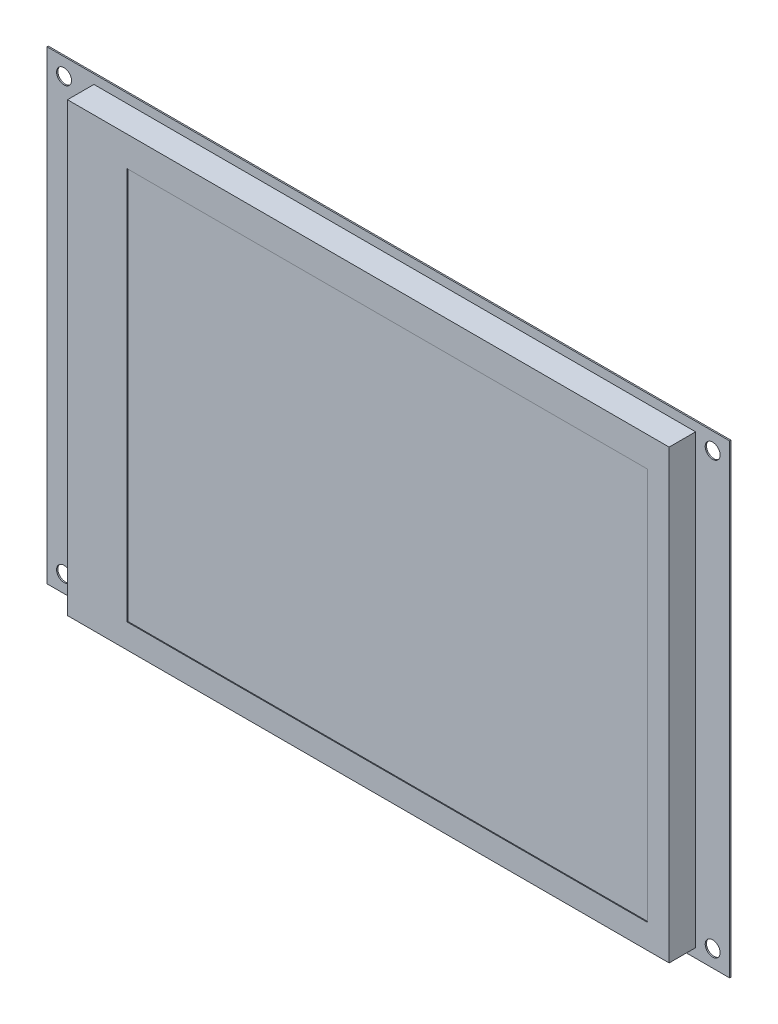
ISO-10303-21;
HEADER;
FILE_DESCRIPTION(('STEP AP214'),'2;1');
FILE_NAME('part.step','',(''),(''),'','','');
FILE_SCHEMA(('AUTOMOTIVE_DESIGN { 1 0 10303 214 1 1 1 1 }'));
ENDSEC;
DATA;
#1=APPLICATION_CONTEXT('core data for automotive mechanical design processes');
#2=APPLICATION_PROTOCOL_DEFINITION('international standard','automotive_design',2000,#1);
#3=PRODUCT_CONTEXT('',#1,'mechanical');
#4=PRODUCT('Part','Part','',(#3));
#5=PRODUCT_RELATED_PRODUCT_CATEGORY('part','',(#4));
#6=PRODUCT_DEFINITION_FORMATION('','',#4);
#7=PRODUCT_DEFINITION_CONTEXT('part definition',#1,'design');
#8=PRODUCT_DEFINITION('design','',#6,#7);
#9=PRODUCT_DEFINITION_SHAPE('','',#8);
#10=(LENGTH_UNIT() NAMED_UNIT(*) SI_UNIT(.MILLI.,.METRE.));
#11=(NAMED_UNIT(*) PLANE_ANGLE_UNIT() SI_UNIT($,.RADIAN.));
#12=(NAMED_UNIT(*) SI_UNIT($,.STERADIAN.) SOLID_ANGLE_UNIT());
#13=UNCERTAINTY_MEASURE_WITH_UNIT(LENGTH_MEASURE(1.E-05),#10,'distance_accuracy_value','');
#14=(GEOMETRIC_REPRESENTATION_CONTEXT(3) GLOBAL_UNCERTAINTY_ASSIGNED_CONTEXT((#13)) GLOBAL_UNIT_ASSIGNED_CONTEXT((#10,
#11,#12)) REPRESENTATION_CONTEXT('',''));
#15=CARTESIAN_POINT('',(0.,0.,0.));
#16=DIRECTION('',(0.,0.,1.));
#17=DIRECTION('',(1.,0.,0.));
#18=AXIS2_PLACEMENT_3D('',#15,#16,#17);
#19=CARTESIAN_POINT('',(0.,0.,6.20000000000001));
#20=DIRECTION('',(1.,0.,0.));
#21=DIRECTION('',(0.,1.,0.));
#22=AXIS2_PLACEMENT_3D('',#19,#20,#21);
#23=PLANE('',#22);
#24=DIRECTION('',(0.,-1.,0.));
#25=VECTOR('',#24,1.);
#26=CARTESIAN_POINT('',(0.,0.,0.));
#27=LINE('',#26,#25);
#28=CARTESIAN_POINT('',(0.,0.,0.));
#29=VERTEX_POINT('',#28);
#30=CARTESIAN_POINT('',(0.,-104.7,0.));
#31=VERTEX_POINT('',#30);
#32=EDGE_CURVE('E206',#29,#31,#27,.T.);
#33=ORIENTED_EDGE('',*,*,#32,.T.);
#34=DIRECTION('',(0.,0.,-1.));
#35=VECTOR('',#34,1.);
#36=CARTESIAN_POINT('',(0.,-104.7,6.20000000000001));
#37=LINE('',#36,#35);
#38=CARTESIAN_POINT('',(0.,-104.7,6.20000000000001));
#39=VERTEX_POINT('',#38);
#40=EDGE_CURVE('E11',#39,#31,#37,.T.);
#41=ORIENTED_EDGE('',*,*,#40,.F.);
#42=DIRECTION('',(0.,-1.,0.));
#43=VECTOR('',#42,1.);
#44=CARTESIAN_POINT('',(0.,0.,6.20000000000001));
#45=LINE('',#44,#43);
#46=CARTESIAN_POINT('',(0.,0.,6.20000000000001));
#47=VERTEX_POINT('',#46);
#48=EDGE_CURVE('E218',#47,#39,#45,.T.);
#49=ORIENTED_EDGE('',*,*,#48,.F.);
#50=DIRECTION('',(0.,0.,-1.));
#51=VECTOR('',#50,1.);
#52=CARTESIAN_POINT('',(0.,0.,6.20000000000001));
#53=LINE('',#52,#51);
#54=EDGE_CURVE('E225',#47,#29,#53,.T.);
#55=ORIENTED_EDGE('',*,*,#54,.T.);
#56=EDGE_LOOP('',(#33,#41,#49,#55));
#57=FACE_BOUND('',#56,.T.);
#58=ADVANCED_FACE('F24',(#57),#23,.F.);
#59=CARTESIAN_POINT('',(0.,-104.7,6.20000000000001));
#60=DIRECTION('',(0.,1.,0.));
#61=DIRECTION('',(-1.,0.,0.));
#62=AXIS2_PLACEMENT_3D('',#59,#60,#61);
#63=PLANE('',#62);
#64=DIRECTION('',(1.,0.,0.));
#65=VECTOR('',#64,1.);
#66=CARTESIAN_POINT('',(0.,-104.7,0.));
#67=LINE('',#66,#65);
#68=CARTESIAN_POINT('',(141.,-104.7,0.));
#69=VERTEX_POINT('',#68);
#70=EDGE_CURVE('E209',#31,#69,#67,.T.);
#71=ORIENTED_EDGE('',*,*,#70,.T.);
#72=DIRECTION('',(0.,0.,-1.));
#73=VECTOR('',#72,1.);
#74=CARTESIAN_POINT('',(141.,-104.7,6.20000000000001));
#75=LINE('',#74,#73);
#76=CARTESIAN_POINT('',(141.,-104.7,6.20000000000001));
#77=VERTEX_POINT('',#76);
#78=EDGE_CURVE('E31',#77,#69,#75,.T.);
#79=ORIENTED_EDGE('',*,*,#78,.F.);
#80=DIRECTION('',(1.,0.,0.));
#81=VECTOR('',#80,1.);
#82=CARTESIAN_POINT('',(0.,-104.7,6.20000000000001));
#83=LINE('',#82,#81);
#84=EDGE_CURVE('E220',#39,#77,#83,.T.);
#85=ORIENTED_EDGE('',*,*,#84,.F.);
#86=ORIENTED_EDGE('',*,*,#40,.T.);
#87=EDGE_LOOP('',(#71,#79,#85,#86));
#88=FACE_BOUND('',#87,.T.);
#89=ADVANCED_FACE('F237',(#88),#63,.F.);
#90=CARTESIAN_POINT('',(141.,0.,6.20000000000001));
#91=DIRECTION('',(-1.,0.,0.));
#92=DIRECTION('',(0.,0.,1.));
#93=AXIS2_PLACEMENT_3D('',#90,#91,#92);
#94=PLANE('',#93);
#95=DIRECTION('',(0.,1.,0.));
#96=VECTOR('',#95,1.);
#97=CARTESIAN_POINT('',(141.,0.,0.));
#98=LINE('',#97,#96);
#99=CARTESIAN_POINT('',(141.,0.,0.));
#100=VERTEX_POINT('',#99);
#101=EDGE_CURVE('E212',#69,#100,#98,.T.);
#102=ORIENTED_EDGE('',*,*,#101,.T.);
#103=DIRECTION('',(0.,0.,-1.));
#104=VECTOR('',#103,1.);
#105=CARTESIAN_POINT('',(141.,0.,6.20000000000001));
#106=LINE('',#105,#104);
#107=CARTESIAN_POINT('',(141.,0.,6.20000000000001));
#108=VERTEX_POINT('',#107);
#109=EDGE_CURVE('E228',#108,#100,#106,.T.);
#110=ORIENTED_EDGE('',*,*,#109,.F.);
#111=DIRECTION('',(0.,1.,0.));
#112=VECTOR('',#111,1.);
#113=CARTESIAN_POINT('',(141.,0.,6.20000000000001));
#114=LINE('',#113,#112);
#115=EDGE_CURVE('E222',#77,#108,#114,.T.);
#116=ORIENTED_EDGE('',*,*,#115,.F.);
#117=ORIENTED_EDGE('',*,*,#78,.T.);
#118=EDGE_LOOP('',(#102,#110,#116,#117));
#119=FACE_BOUND('',#118,.T.);
#120=ADVANCED_FACE('F234',(#119),#94,.F.);
#121=CARTESIAN_POINT('',(0.,0.,6.20000000000001));
#122=DIRECTION('',(0.,-1.,0.));
#123=DIRECTION('',(0.,0.,-1.));
#124=AXIS2_PLACEMENT_3D('',#121,#122,#123);
#125=PLANE('',#124);
#126=DIRECTION('',(-1.,0.,0.));
#127=VECTOR('',#126,1.);
#128=CARTESIAN_POINT('',(0.,0.,0.));
#129=LINE('',#128,#127);
#130=EDGE_CURVE('E215',#100,#29,#129,.T.);
#131=ORIENTED_EDGE('',*,*,#130,.T.);
#132=ORIENTED_EDGE('',*,*,#54,.F.);
#133=DIRECTION('',(-1.,0.,0.));
#134=VECTOR('',#133,1.);
#135=CARTESIAN_POINT('',(0.,0.,6.20000000000001));
#136=LINE('',#135,#134);
#137=EDGE_CURVE('E46',#108,#47,#136,.T.);
#138=ORIENTED_EDGE('',*,*,#137,.F.);
#139=ORIENTED_EDGE('',*,*,#109,.T.);
#140=EDGE_LOOP('',(#131,#132,#138,#139));
#141=FACE_BOUND('',#140,.T.);
#142=ADVANCED_FACE('F242',(#141),#125,.F.);
#143=CARTESIAN_POINT('',(0.,-104.7,6.20000000000001));
#144=DIRECTION('',(0.,0.,1.));
#145=DIRECTION('',(1.,0.,0.));
#146=AXIS2_PLACEMENT_3D('',#143,#144,#145);
#147=PLANE('',#146);
#148=DIRECTION('',(0.,-1.,0.));
#149=VECTOR('',#148,1.);
#150=CARTESIAN_POINT('',(13.9858066683462,-6.99852607709749,6.20000000000001));
#151=LINE('',#150,#149);
#152=CARTESIAN_POINT('',(13.9858066683462,-6.99852607709749,6.20000000000001));
#153=VERTEX_POINT('',#152);
#154=CARTESIAN_POINT('',(13.9858066683462,-98.9985260770975,6.20000000000001));
#155=VERTEX_POINT('',#154);
#156=EDGE_CURVE('E38',#153,#155,#151,.T.);
#157=ORIENTED_EDGE('',*,*,#156,.F.);
#158=DIRECTION('',(-1.,0.,0.));
#159=VECTOR('',#158,1.);
#160=CARTESIAN_POINT('',(13.9858066683462,-6.99852607709749,6.20000000000001));
#161=LINE('',#160,#159);
#162=CARTESIAN_POINT('',(135.985806668346,-6.99852607709749,6.20000000000001));
#163=VERTEX_POINT('',#162);
#164=EDGE_CURVE('E134',#163,#153,#161,.T.);
#165=ORIENTED_EDGE('',*,*,#164,.F.);
#166=DIRECTION('',(0.,1.,0.));
#167=VECTOR('',#166,1.);
#168=CARTESIAN_POINT('',(135.985806668346,-6.99852607709749,6.20000000000001));
#169=LINE('',#168,#167);
#170=CARTESIAN_POINT('',(135.985806668346,-98.9985260770975,6.20000000000001));
#171=VERTEX_POINT('',#170);
#172=EDGE_CURVE('E117',#171,#163,#169,.T.);
#173=ORIENTED_EDGE('',*,*,#172,.F.);
#174=DIRECTION('',(1.,0.,0.));
#175=VECTOR('',#174,1.);
#176=CARTESIAN_POINT('',(13.9858066683462,-98.9985260770975,6.20000000000001));
#177=LINE('',#176,#175);
#178=EDGE_CURVE('E128',#155,#171,#177,.T.);
#179=ORIENTED_EDGE('',*,*,#178,.F.);
#180=EDGE_LOOP('',(#157,#165,#173,#179));
#181=FACE_BOUND('',#180,.T.);
#182=ORIENTED_EDGE('',*,*,#48,.T.);
#183=ORIENTED_EDGE('',*,*,#84,.T.);
#184=ORIENTED_EDGE('',*,*,#115,.T.);
#185=ORIENTED_EDGE('',*,*,#137,.T.);
#186=EDGE_LOOP('',(#182,#183,#184,#185));
#187=FACE_BOUND('',#186,.T.);
#188=ADVANCED_FACE('F132',(#181,#187),#147,.T.);
#189=CARTESIAN_POINT('',(149.,-106.85,0.));
#190=DIRECTION('',(0.,0.,-1.));
#191=DIRECTION('',(-1.,0.,0.));
#192=AXIS2_PLACEMENT_3D('',#189,#190,#191);
#193=PLANE('',#192);
#194=CARTESIAN_POINT('',(-7.00000000000001,-102.85,0.));
#195=DIRECTION('',(0.,0.,1.));
#196=DIRECTION('',(1.,0.,0.));
#197=AXIS2_PLACEMENT_3D('',#194,#195,#196);
#198=CIRCLE('',#197,1.75);
#199=CARTESIAN_POINT('',(-5.25000000000001,-102.85,0.));
#200=VERTEX_POINT('',#199);
#201=EDGE_CURVE('E150',#200,#200,#198,.T.);
#202=ORIENTED_EDGE('',*,*,#201,.F.);
#203=EDGE_LOOP('',(#202));
#204=FACE_BOUND('',#203,.T.);
#205=CARTESIAN_POINT('',(-7.00000000000001,-1.84999999999999,0.));
#206=DIRECTION('',(0.,0.,1.));
#207=DIRECTION('',(1.,0.,0.));
#208=AXIS2_PLACEMENT_3D('',#205,#206,#207);
#209=CIRCLE('',#208,1.75);
#210=CARTESIAN_POINT('',(-5.25000000000001,-1.84999999999999,0.));
#211=VERTEX_POINT('',#210);
#212=EDGE_CURVE('E158',#211,#211,#209,.T.);
#213=ORIENTED_EDGE('',*,*,#212,.F.);
#214=EDGE_LOOP('',(#213));
#215=FACE_BOUND('',#214,.T.);
#216=CARTESIAN_POINT('',(145.,-102.85,0.));
#217=DIRECTION('',(0.,0.,1.));
#218=DIRECTION('',(1.,0.,0.));
#219=AXIS2_PLACEMENT_3D('',#216,#217,#218);
#220=CIRCLE('',#219,1.75000000000001);
#221=CARTESIAN_POINT('',(146.75,-102.85,0.));
#222=VERTEX_POINT('',#221);
#223=EDGE_CURVE('E164',#222,#222,#220,.T.);
#224=ORIENTED_EDGE('',*,*,#223,.F.);
#225=EDGE_LOOP('',(#224));
#226=FACE_BOUND('',#225,.T.);
#227=CARTESIAN_POINT('',(145.,-1.84999999999999,0.));
#228=DIRECTION('',(0.,0.,1.));
#229=DIRECTION('',(1.,0.,0.));
#230=AXIS2_PLACEMENT_3D('',#227,#228,#229);
#231=CIRCLE('',#230,1.75000000000001);
#232=CARTESIAN_POINT('',(146.75,-1.84999999999999,0.));
#233=VERTEX_POINT('',#232);
#234=EDGE_CURVE('E170',#233,#233,#231,.T.);
#235=ORIENTED_EDGE('',*,*,#234,.F.);
#236=EDGE_LOOP('',(#235));
#237=FACE_BOUND('',#236,.T.);
#238=DIRECTION('',(0.,-1.,0.));
#239=VECTOR('',#238,1.);
#240=CARTESIAN_POINT('',(149.,2.15,0.));
#241=LINE('',#240,#239);
#242=CARTESIAN_POINT('',(149.,2.15,0.));
#243=VERTEX_POINT('',#242);
#244=CARTESIAN_POINT('',(149.,-106.85,0.));
#245=VERTEX_POINT('',#244);
#246=EDGE_CURVE('E176',#243,#245,#241,.T.);
#247=ORIENTED_EDGE('',*,*,#246,.F.);
#248=DIRECTION('',(1.,0.,0.));
#249=VECTOR('',#248,1.);
#250=CARTESIAN_POINT('',(149.,2.15,0.));
#251=LINE('',#250,#249);
#252=CARTESIAN_POINT('',(-11.,2.15,0.));
#253=VERTEX_POINT('',#252);
#254=EDGE_CURVE('E183',#253,#243,#251,.T.);
#255=ORIENTED_EDGE('',*,*,#254,.F.);
#256=DIRECTION('',(0.,1.,0.));
#257=VECTOR('',#256,1.);
#258=CARTESIAN_POINT('',(-11.,2.15,0.));
#259=LINE('',#258,#257);
#260=CARTESIAN_POINT('',(-11.,-106.85,0.));
#261=VERTEX_POINT('',#260);
#262=EDGE_CURVE('E181',#261,#253,#259,.T.);
#263=ORIENTED_EDGE('',*,*,#262,.F.);
#264=DIRECTION('',(-1.,0.,0.));
#265=VECTOR('',#264,1.);
#266=CARTESIAN_POINT('',(149.,-106.85,0.));
#267=LINE('',#266,#265);
#268=EDGE_CURVE('E179',#245,#261,#267,.T.);
#269=ORIENTED_EDGE('',*,*,#268,.F.);
#270=EDGE_LOOP('',(#247,#255,#263,#269));
#271=FACE_BOUND('',#270,.T.);
#272=ORIENTED_EDGE('',*,*,#70,.F.);
#273=ORIENTED_EDGE('',*,*,#32,.F.);
#274=ORIENTED_EDGE('',*,*,#130,.F.);
#275=ORIENTED_EDGE('',*,*,#101,.F.);
#276=EDGE_LOOP('',(#272,#273,#274,#275));
#277=FACE_BOUND('',#276,.T.);
#278=ADVANCED_FACE('F240',(#204,#215,#226,#237,#271,#277),#193,.F.);
#279=CARTESIAN_POINT('',(149.,2.15,-0.299999999999995));
#280=DIRECTION('',(-1.,0.,0.));
#281=DIRECTION('',(0.,0.,1.));
#282=AXIS2_PLACEMENT_3D('',#279,#280,#281);
#283=PLANE('',#282);
#284=ORIENTED_EDGE('',*,*,#246,.T.);
#285=DIRECTION('',(0.,0.,1.));
#286=VECTOR('',#285,1.);
#287=CARTESIAN_POINT('',(149.,-106.85,-0.299999999999995));
#288=LINE('',#287,#286);
#289=CARTESIAN_POINT('',(149.,-106.85,-0.299999999999995));
#290=VERTEX_POINT('',#289);
#291=EDGE_CURVE('E203',#290,#245,#288,.T.);
#292=ORIENTED_EDGE('',*,*,#291,.F.);
#293=DIRECTION('',(0.,-1.,0.));
#294=VECTOR('',#293,1.);
#295=CARTESIAN_POINT('',(149.,2.15,-0.299999999999995));
#296=LINE('',#295,#294);
#297=CARTESIAN_POINT('',(149.,2.15,-0.299999999999995));
#298=VERTEX_POINT('',#297);
#299=EDGE_CURVE('E185',#298,#290,#296,.T.);
#300=ORIENTED_EDGE('',*,*,#299,.F.);
#301=DIRECTION('',(0.,0.,1.));
#302=VECTOR('',#301,1.);
#303=CARTESIAN_POINT('',(149.,2.15,-0.299999999999995));
#304=LINE('',#303,#302);
#305=EDGE_CURVE('E194',#298,#243,#304,.T.);
#306=ORIENTED_EDGE('',*,*,#305,.T.);
#307=EDGE_LOOP('',(#284,#292,#300,#306));
#308=FACE_BOUND('',#307,.T.);
#309=ADVANCED_FACE('F251',(#308),#283,.F.);
#310=CARTESIAN_POINT('',(149.,-106.85,-0.299999999999995));
#311=DIRECTION('',(0.,1.,0.));
#312=DIRECTION('',(0.,0.,1.));
#313=AXIS2_PLACEMENT_3D('',#310,#311,#312);
#314=PLANE('',#313);
#315=ORIENTED_EDGE('',*,*,#268,.T.);
#316=DIRECTION('',(0.,0.,1.));
#317=VECTOR('',#316,1.);
#318=CARTESIAN_POINT('',(-11.,-106.85,-0.299999999999995));
#319=LINE('',#318,#317);
#320=CARTESIAN_POINT('',(-11.,-106.85,-0.299999999999995));
#321=VERTEX_POINT('',#320);
#322=EDGE_CURVE('E200',#321,#261,#319,.T.);
#323=ORIENTED_EDGE('',*,*,#322,.F.);
#324=DIRECTION('',(-1.,0.,0.));
#325=VECTOR('',#324,1.);
#326=CARTESIAN_POINT('',(149.,-106.85,-0.299999999999995));
#327=LINE('',#326,#325);
#328=EDGE_CURVE('E188',#290,#321,#327,.T.);
#329=ORIENTED_EDGE('',*,*,#328,.F.);
#330=ORIENTED_EDGE('',*,*,#291,.T.);
#331=EDGE_LOOP('',(#315,#323,#329,#330));
#332=FACE_BOUND('',#331,.T.);
#333=ADVANCED_FACE('F270',(#332),#314,.F.);
#334=CARTESIAN_POINT('',(-11.,2.15,-0.299999999999995));
#335=DIRECTION('',(1.,0.,0.));
#336=DIRECTION('',(0.,0.,-1.));
#337=AXIS2_PLACEMENT_3D('',#334,#335,#336);
#338=PLANE('',#337);
#339=ORIENTED_EDGE('',*,*,#262,.T.);
#340=DIRECTION('',(0.,0.,1.));
#341=VECTOR('',#340,1.);
#342=CARTESIAN_POINT('',(-11.,2.15,-0.299999999999995));
#343=LINE('',#342,#341);
#344=CARTESIAN_POINT('',(-11.,2.15,-0.299999999999995));
#345=VERTEX_POINT('',#344);
#346=EDGE_CURVE('E197',#345,#253,#343,.T.);
#347=ORIENTED_EDGE('',*,*,#346,.F.);
#348=DIRECTION('',(0.,1.,0.));
#349=VECTOR('',#348,1.);
#350=CARTESIAN_POINT('',(-11.,2.15,-0.299999999999995));
#351=LINE('',#350,#349);
#352=EDGE_CURVE('E190',#321,#345,#351,.T.);
#353=ORIENTED_EDGE('',*,*,#352,.F.);
#354=ORIENTED_EDGE('',*,*,#322,.T.);
#355=EDGE_LOOP('',(#339,#347,#353,#354));
#356=FACE_BOUND('',#355,.T.);
#357=ADVANCED_FACE('F274',(#356),#338,.F.);
#358=CARTESIAN_POINT('',(149.,2.15,-0.299999999999995));
#359=DIRECTION('',(0.,-1.,0.));
#360=DIRECTION('',(0.,0.,-1.));
#361=AXIS2_PLACEMENT_3D('',#358,#359,#360);
#362=PLANE('',#361);
#363=ORIENTED_EDGE('',*,*,#254,.T.);
#364=ORIENTED_EDGE('',*,*,#305,.F.);
#365=DIRECTION('',(1.,0.,0.));
#366=VECTOR('',#365,1.);
#367=CARTESIAN_POINT('',(149.,2.15,-0.299999999999995));
#368=LINE('',#367,#366);
#369=EDGE_CURVE('E192',#345,#298,#368,.T.);
#370=ORIENTED_EDGE('',*,*,#369,.F.);
#371=ORIENTED_EDGE('',*,*,#346,.T.);
#372=EDGE_LOOP('',(#363,#364,#370,#371));
#373=FACE_BOUND('',#372,.T.);
#374=ADVANCED_FACE('F278',(#373),#362,.F.);
#375=CARTESIAN_POINT('',(149.,-106.85,-0.299999999999995));
#376=DIRECTION('',(0.,0.,-1.));
#377=DIRECTION('',(-1.,0.,0.));
#378=AXIS2_PLACEMENT_3D('',#375,#376,#377);
#379=PLANE('',#378);
#380=CARTESIAN_POINT('',(-7.00000000000001,-102.85,-0.299999999999995));
#381=DIRECTION('',(0.,0.,1.));
#382=DIRECTION('',(1.,0.,0.));
#383=AXIS2_PLACEMENT_3D('',#380,#381,#382);
#384=CIRCLE('',#383,1.75);
#385=CARTESIAN_POINT('',(-5.25000000000001,-102.85,-0.299999999999995));
#386=VERTEX_POINT('',#385);
#387=EDGE_CURVE('E155',#386,#386,#384,.T.);
#388=ORIENTED_EDGE('',*,*,#387,.T.);
#389=EDGE_LOOP('',(#388));
#390=FACE_BOUND('',#389,.T.);
#391=CARTESIAN_POINT('',(-7.00000000000001,-1.84999999999999,-0.299999999999995));
#392=DIRECTION('',(0.,0.,1.));
#393=DIRECTION('',(1.,0.,0.));
#394=AXIS2_PLACEMENT_3D('',#391,#392,#393);
#395=CIRCLE('',#394,1.75);
#396=CARTESIAN_POINT('',(-5.25000000000001,-1.84999999999999,-0.299999999999995));
#397=VERTEX_POINT('',#396);
#398=EDGE_CURVE('E161',#397,#397,#395,.T.);
#399=ORIENTED_EDGE('',*,*,#398,.T.);
#400=EDGE_LOOP('',(#399));
#401=FACE_BOUND('',#400,.T.);
#402=CARTESIAN_POINT('',(145.,-102.85,-0.299999999999995));
#403=DIRECTION('',(0.,0.,1.));
#404=DIRECTION('',(1.,0.,0.));
#405=AXIS2_PLACEMENT_3D('',#402,#403,#404);
#406=CIRCLE('',#405,1.75000000000001);
#407=CARTESIAN_POINT('',(146.75,-102.85,-0.299999999999995));
#408=VERTEX_POINT('',#407);
#409=EDGE_CURVE('E167',#408,#408,#406,.T.);
#410=ORIENTED_EDGE('',*,*,#409,.T.);
#411=EDGE_LOOP('',(#410));
#412=FACE_BOUND('',#411,.T.);
#413=CARTESIAN_POINT('',(145.,-1.84999999999999,-0.299999999999995));
#414=DIRECTION('',(0.,0.,1.));
#415=DIRECTION('',(1.,0.,0.));
#416=AXIS2_PLACEMENT_3D('',#413,#414,#415);
#417=CIRCLE('',#416,1.75000000000001);
#418=CARTESIAN_POINT('',(146.75,-1.84999999999999,-0.299999999999995));
#419=VERTEX_POINT('',#418);
#420=EDGE_CURVE('E173',#419,#419,#417,.T.);
#421=ORIENTED_EDGE('',*,*,#420,.T.);
#422=EDGE_LOOP('',(#421));
#423=FACE_BOUND('',#422,.T.);
#424=ORIENTED_EDGE('',*,*,#299,.T.);
#425=ORIENTED_EDGE('',*,*,#328,.T.);
#426=ORIENTED_EDGE('',*,*,#352,.T.);
#427=ORIENTED_EDGE('',*,*,#369,.T.);
#428=EDGE_LOOP('',(#424,#425,#426,#427));
#429=FACE_BOUND('',#428,.T.);
#430=ADVANCED_FACE('F282',(#390,#401,#412,#423,#429),#379,.T.);
#431=CARTESIAN_POINT('',(145.,-1.84999999999999,-0.299999999999995));
#432=DIRECTION('',(0.,0.,1.));
#433=DIRECTION('',(1.,0.,0.));
#434=AXIS2_PLACEMENT_3D('',#431,#432,#433);
#435=CYLINDRICAL_SURFACE('',#434,1.75000000000001);
#436=ORIENTED_EDGE('',*,*,#420,.F.);
#437=EDGE_LOOP('',(#436));
#438=FACE_BOUND('',#437,.T.);
#439=ORIENTED_EDGE('',*,*,#234,.T.);
#440=EDGE_LOOP('',(#439));
#441=FACE_BOUND('',#440,.T.);
#442=ADVANCED_FACE('F285',(#438,#441),#435,.F.);
#443=CARTESIAN_POINT('',(145.,-102.85,-0.299999999999995));
#444=DIRECTION('',(0.,0.,1.));
#445=DIRECTION('',(1.,0.,0.));
#446=AXIS2_PLACEMENT_3D('',#443,#444,#445);
#447=CYLINDRICAL_SURFACE('',#446,1.75000000000001);
#448=ORIENTED_EDGE('',*,*,#409,.F.);
#449=EDGE_LOOP('',(#448));
#450=FACE_BOUND('',#449,.T.);
#451=ORIENTED_EDGE('',*,*,#223,.T.);
#452=EDGE_LOOP('',(#451));
#453=FACE_BOUND('',#452,.T.);
#454=ADVANCED_FACE('F290',(#450,#453),#447,.F.);
#455=CARTESIAN_POINT('',(-7.00000000000001,-1.84999999999999,-0.299999999999995));
#456=DIRECTION('',(0.,0.,1.));
#457=DIRECTION('',(1.,0.,0.));
#458=AXIS2_PLACEMENT_3D('',#455,#456,#457);
#459=CYLINDRICAL_SURFACE('',#458,1.75);
#460=ORIENTED_EDGE('',*,*,#398,.F.);
#461=EDGE_LOOP('',(#460));
#462=FACE_BOUND('',#461,.T.);
#463=ORIENTED_EDGE('',*,*,#212,.T.);
#464=EDGE_LOOP('',(#463));
#465=FACE_BOUND('',#464,.T.);
#466=ADVANCED_FACE('F294',(#462,#465),#459,.F.);
#467=CARTESIAN_POINT('',(-7.00000000000001,-102.85,-0.299999999999995));
#468=DIRECTION('',(0.,0.,1.));
#469=DIRECTION('',(1.,0.,0.));
#470=AXIS2_PLACEMENT_3D('',#467,#468,#469);
#471=CYLINDRICAL_SURFACE('',#470,1.75);
#472=ORIENTED_EDGE('',*,*,#387,.F.);
#473=EDGE_LOOP('',(#472));
#474=FACE_BOUND('',#473,.T.);
#475=ORIENTED_EDGE('',*,*,#201,.T.);
#476=EDGE_LOOP('',(#475));
#477=FACE_BOUND('',#476,.T.);
#478=ADVANCED_FACE('F298',(#474,#477),#471,.F.);
#479=CARTESIAN_POINT('',(13.9858066683462,-6.99852607709749,6.00000000000001));
#480=DIRECTION('',(-1.,0.,0.));
#481=DIRECTION('',(0.,-1.,0.));
#482=AXIS2_PLACEMENT_3D('',#479,#480,#481);
#483=PLANE('',#482);
#484=ORIENTED_EDGE('',*,*,#156,.T.);
#485=DIRECTION('',(0.,0.,1.));
#486=VECTOR('',#485,1.);
#487=CARTESIAN_POINT('',(13.9858066683462,-98.9985260770975,6.00000000000001));
#488=LINE('',#487,#486);
#489=CARTESIAN_POINT('',(13.9858066683462,-98.9985260770975,6.00000000000001));
#490=VERTEX_POINT('',#489);
#491=EDGE_CURVE('E125',#490,#155,#488,.T.);
#492=ORIENTED_EDGE('',*,*,#491,.F.);
#493=DIRECTION('',(0.,-1.,0.));
#494=VECTOR('',#493,1.);
#495=CARTESIAN_POINT('',(13.9858066683462,-6.99852607709749,6.00000000000001));
#496=LINE('',#495,#494);
#497=CARTESIAN_POINT('',(13.9858066683462,-6.99852607709749,6.00000000000001));
#498=VERTEX_POINT('',#497);
#499=EDGE_CURVE('E136',#498,#490,#496,.T.);
#500=ORIENTED_EDGE('',*,*,#499,.F.);
#501=DIRECTION('',(0.,0.,1.));
#502=VECTOR('',#501,1.);
#503=CARTESIAN_POINT('',(13.9858066683462,-6.99852607709749,6.00000000000001));
#504=LINE('',#503,#502);
#505=EDGE_CURVE('E148',#498,#153,#504,.T.);
#506=ORIENTED_EDGE('',*,*,#505,.T.);
#507=EDGE_LOOP('',(#484,#492,#500,#506));
#508=FACE_BOUND('',#507,.T.);
#509=ADVANCED_FACE('F302',(#508),#483,.F.);
#510=CARTESIAN_POINT('',(13.9858066683462,-6.99852607709749,6.00000000000001));
#511=DIRECTION('',(0.,1.,0.));
#512=DIRECTION('',(0.,0.,1.));
#513=AXIS2_PLACEMENT_3D('',#510,#511,#512);
#514=PLANE('',#513);
#515=ORIENTED_EDGE('',*,*,#164,.T.);
#516=ORIENTED_EDGE('',*,*,#505,.F.);
#517=DIRECTION('',(-1.,0.,0.));
#518=VECTOR('',#517,1.);
#519=CARTESIAN_POINT('',(13.9858066683462,-6.99852607709749,6.00000000000001));
#520=LINE('',#519,#518);
#521=CARTESIAN_POINT('',(135.985806668346,-6.99852607709749,6.00000000000001));
#522=VERTEX_POINT('',#521);
#523=EDGE_CURVE('E145',#522,#498,#520,.T.);
#524=ORIENTED_EDGE('',*,*,#523,.F.);
#525=DIRECTION('',(0.,0.,1.));
#526=VECTOR('',#525,1.);
#527=CARTESIAN_POINT('',(135.985806668346,-6.99852607709749,6.00000000000001));
#528=LINE('',#527,#526);
#529=EDGE_CURVE('E124',#522,#163,#528,.T.);
#530=ORIENTED_EDGE('',*,*,#529,.T.);
#531=EDGE_LOOP('',(#515,#516,#524,#530));
#532=FACE_BOUND('',#531,.T.);
#533=ADVANCED_FACE('F306',(#532),#514,.F.);
#534=CARTESIAN_POINT('',(135.985806668346,-6.99852607709749,6.00000000000001));
#535=DIRECTION('',(1.,0.,0.));
#536=DIRECTION('',(0.,0.,-1.));
#537=AXIS2_PLACEMENT_3D('',#534,#535,#536);
#538=PLANE('',#537);
#539=ORIENTED_EDGE('',*,*,#172,.T.);
#540=ORIENTED_EDGE('',*,*,#529,.F.);
#541=DIRECTION('',(0.,1.,0.));
#542=VECTOR('',#541,1.);
#543=CARTESIAN_POINT('',(135.985806668346,-6.99852607709749,6.00000000000001));
#544=LINE('',#543,#542);
#545=CARTESIAN_POINT('',(135.985806668346,-98.9985260770975,6.00000000000001));
#546=VERTEX_POINT('',#545);
#547=EDGE_CURVE('E120',#546,#522,#544,.T.);
#548=ORIENTED_EDGE('',*,*,#547,.F.);
#549=DIRECTION('',(0.,0.,1.));
#550=VECTOR('',#549,1.);
#551=CARTESIAN_POINT('',(135.985806668346,-98.9985260770975,6.00000000000001));
#552=LINE('',#551,#550);
#553=EDGE_CURVE('E113',#546,#171,#552,.T.);
#554=ORIENTED_EDGE('',*,*,#553,.T.);
#555=EDGE_LOOP('',(#539,#540,#548,#554));
#556=FACE_BOUND('',#555,.T.);
#557=ADVANCED_FACE('F115',(#556),#538,.F.);
#558=CARTESIAN_POINT('',(13.9858066683462,-98.9985260770975,6.00000000000001));
#559=DIRECTION('',(0.,-1.,0.));
#560=DIRECTION('',(0.,0.,-1.));
#561=AXIS2_PLACEMENT_3D('',#558,#559,#560);
#562=PLANE('',#561);
#563=ORIENTED_EDGE('',*,*,#178,.T.);
#564=ORIENTED_EDGE('',*,*,#553,.F.);
#565=DIRECTION('',(1.,0.,0.));
#566=VECTOR('',#565,1.);
#567=CARTESIAN_POINT('',(13.9858066683462,-98.9985260770975,6.00000000000001));
#568=LINE('',#567,#566);
#569=EDGE_CURVE('E142',#490,#546,#568,.T.);
#570=ORIENTED_EDGE('',*,*,#569,.F.);
#571=ORIENTED_EDGE('',*,*,#491,.T.);
#572=EDGE_LOOP('',(#563,#564,#570,#571));
#573=FACE_BOUND('',#572,.T.);
#574=ADVANCED_FACE('F129',(#573),#562,.F.);
#575=CARTESIAN_POINT('',(13.9858066683462,-6.99852607709749,6.00000000000001));
#576=DIRECTION('',(0.,0.,1.));
#577=DIRECTION('',(1.,0.,0.));
#578=AXIS2_PLACEMENT_3D('',#575,#576,#577);
#579=PLANE('',#578);
#580=ORIENTED_EDGE('',*,*,#499,.T.);
#581=ORIENTED_EDGE('',*,*,#569,.T.);
#582=ORIENTED_EDGE('',*,*,#547,.T.);
#583=ORIENTED_EDGE('',*,*,#523,.T.);
#584=EDGE_LOOP('',(#580,#581,#582,#583));
#585=FACE_BOUND('',#584,.T.);
#586=ADVANCED_FACE('F309',(#585),#579,.T.);
#587=CLOSED_SHELL('',(#58,#89,#120,#142,#188,#278,#309,#333,#357,#374,#430,#442,#454,#466,#478,
#509,#533,#557,#574,#586));
#588=MANIFOLD_SOLID_BREP('B2',#587);
#589=ADVANCED_BREP_SHAPE_REPRESENTATION('',(#18,#588),#14);
#590=SHAPE_DEFINITION_REPRESENTATION(#9,#589);
ENDSEC;
END-ISO-10303-21;
